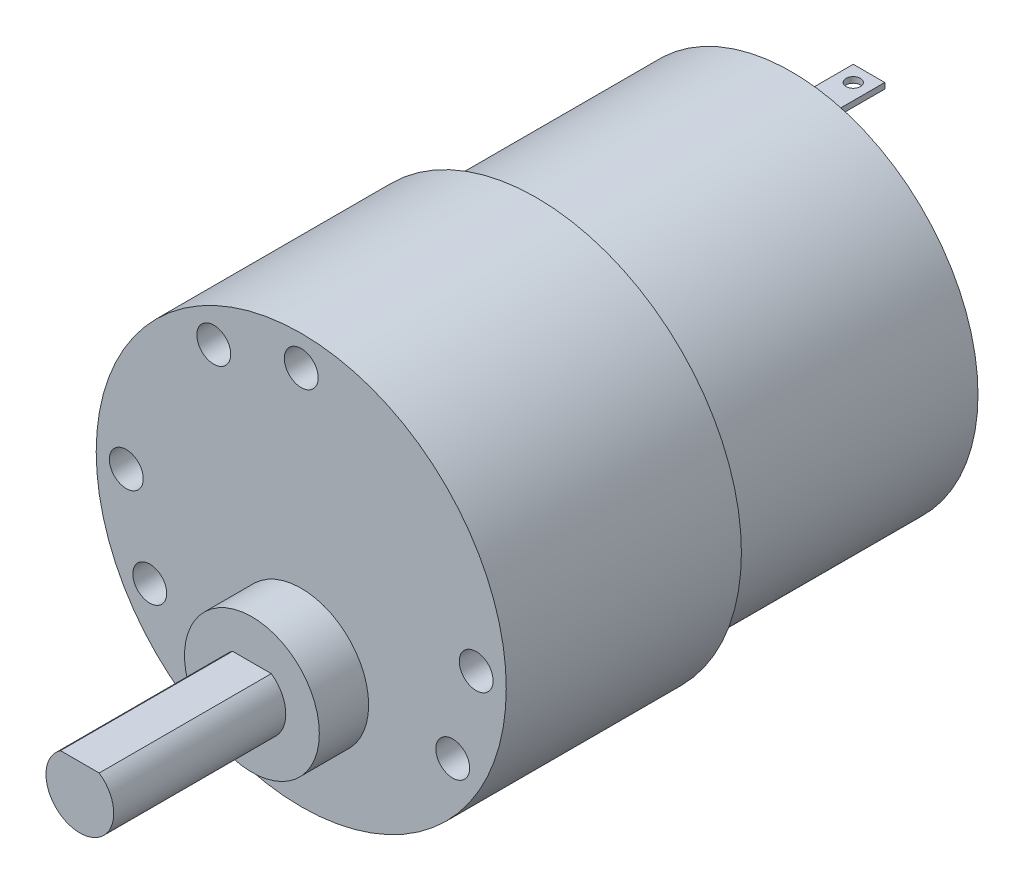
ISO-10303-21;
HEADER;
FILE_DESCRIPTION(('STEP AP214'),'2;1');
FILE_NAME('part.step','',(''),(''),'','','');
FILE_SCHEMA(('AUTOMOTIVE_DESIGN { 1 0 10303 214 1 1 1 1 }'));
ENDSEC;
DATA;
#1=APPLICATION_CONTEXT('core data for automotive mechanical design processes');
#2=APPLICATION_PROTOCOL_DEFINITION('international standard','automotive_design',2000,#1);
#3=PRODUCT_CONTEXT('',#1,'mechanical');
#4=PRODUCT('Part','Part','',(#3));
#5=PRODUCT_RELATED_PRODUCT_CATEGORY('part','',(#4));
#6=PRODUCT_DEFINITION_FORMATION('','',#4);
#7=PRODUCT_DEFINITION_CONTEXT('part definition',#1,'design');
#8=PRODUCT_DEFINITION('design','',#6,#7);
#9=PRODUCT_DEFINITION_SHAPE('','',#8);
#10=(LENGTH_UNIT() NAMED_UNIT(*) SI_UNIT(.MILLI.,.METRE.));
#11=(NAMED_UNIT(*) PLANE_ANGLE_UNIT() SI_UNIT($,.RADIAN.));
#12=(NAMED_UNIT(*) SI_UNIT($,.STERADIAN.) SOLID_ANGLE_UNIT());
#13=UNCERTAINTY_MEASURE_WITH_UNIT(LENGTH_MEASURE(1.E-05),#10,'distance_accuracy_value','');
#14=(GEOMETRIC_REPRESENTATION_CONTEXT(3) GLOBAL_UNCERTAINTY_ASSIGNED_CONTEXT((#13)) GLOBAL_UNIT_ASSIGNED_CONTEXT((#10,
#11,#12)) REPRESENTATION_CONTEXT('',''));
#15=CARTESIAN_POINT('',(0.,0.,0.));
#16=DIRECTION('',(0.,0.,1.));
#17=DIRECTION('',(1.,0.,0.));
#18=AXIS2_PLACEMENT_3D('',#15,#16,#17);
#19=CARTESIAN_POINT('',(0.,-12.7,-23.876));
#20=DIRECTION('',(0.,0.,-1.));
#21=DIRECTION('',(-1.,0.,0.));
#22=AXIS2_PLACEMENT_3D('',#19,#20,#21);
#23=PLANE('',#22);
#24=CARTESIAN_POINT('',(0.,-12.7,-23.876));
#25=DIRECTION('',(0.,0.,-1.));
#26=DIRECTION('',(-1.,0.,0.));
#27=AXIS2_PLACEMENT_3D('',#24,#25,#26);
#28=CIRCLE('',#27,2.413);
#29=CARTESIAN_POINT('',(-2.413,-12.7,-23.876));
#30=VERTEX_POINT('',#29);
#31=EDGE_CURVE('E278',#30,#30,#28,.T.);
#32=ORIENTED_EDGE('',*,*,#31,.T.);
#33=EDGE_LOOP('',(#32));
#34=FACE_BOUND('',#33,.T.);
#35=DIRECTION('',(-1.,0.,0.));
#36=VECTOR('',#35,1.);
#37=CARTESIAN_POINT('',(-1.397,-12.446,-23.876));
#38=LINE('',#37,#36);
#39=CARTESIAN_POINT('',(1.397,-12.446,-23.876));
#40=VERTEX_POINT('',#39);
#41=CARTESIAN_POINT('',(-1.397,-12.446,-23.876));
#42=VERTEX_POINT('',#41);
#43=EDGE_CURVE('E48',#40,#42,#38,.T.);
#44=ORIENTED_EDGE('',*,*,#43,.T.);
#45=DIRECTION('',(0.,1.,0.));
#46=VECTOR('',#45,1.);
#47=CARTESIAN_POINT('',(-1.397,-12.954,-23.876));
#48=LINE('',#47,#46);
#49=CARTESIAN_POINT('',(-1.397,-12.954,-23.876));
#50=VERTEX_POINT('',#49);
#51=EDGE_CURVE('E213',#50,#42,#48,.T.);
#52=ORIENTED_EDGE('',*,*,#51,.F.);
#53=DIRECTION('',(-1.,0.,0.));
#54=VECTOR('',#53,1.);
#55=CARTESIAN_POINT('',(-1.397,-12.954,-23.876));
#56=LINE('',#55,#54);
#57=CARTESIAN_POINT('',(1.397,-12.954,-23.876));
#58=VERTEX_POINT('',#57);
#59=EDGE_CURVE('E188',#58,#50,#56,.T.);
#60=ORIENTED_EDGE('',*,*,#59,.F.);
#61=DIRECTION('',(0.,1.,0.));
#62=VECTOR('',#61,1.);
#63=CARTESIAN_POINT('',(1.397,-12.954,-23.876));
#64=LINE('',#63,#62);
#65=EDGE_CURVE('E198',#58,#40,#64,.T.);
#66=ORIENTED_EDGE('',*,*,#65,.T.);
#67=EDGE_LOOP('',(#44,#52,#60,#66));
#68=FACE_BOUND('',#67,.T.);
#69=ADVANCED_FACE('F33',(#34,#68),#23,.T.);
#70=CARTESIAN_POINT('',(0.,12.7,-23.876));
#71=DIRECTION('',(0.,0.,-1.));
#72=DIRECTION('',(-1.,0.,0.));
#73=AXIS2_PLACEMENT_3D('',#70,#71,#72);
#74=PLANE('',#73);
#75=CARTESIAN_POINT('',(0.,12.7,-23.876));
#76=DIRECTION('',(0.,0.,-1.));
#77=DIRECTION('',(-1.,0.,0.));
#78=AXIS2_PLACEMENT_3D('',#75,#76,#77);
#79=CIRCLE('',#78,2.413);
#80=CARTESIAN_POINT('',(-2.413,12.7,-23.876));
#81=VERTEX_POINT('',#80);
#82=EDGE_CURVE('E272',#81,#81,#79,.T.);
#83=ORIENTED_EDGE('',*,*,#82,.T.);
#84=EDGE_LOOP('',(#83));
#85=FACE_BOUND('',#84,.T.);
#86=DIRECTION('',(1.,0.,0.));
#87=VECTOR('',#86,1.);
#88=CARTESIAN_POINT('',(1.397,12.446,-23.876));
#89=LINE('',#88,#87);
#90=CARTESIAN_POINT('',(-1.397,12.446,-23.876));
#91=VERTEX_POINT('',#90);
#92=CARTESIAN_POINT('',(1.397,12.446,-23.876));
#93=VERTEX_POINT('',#92);
#94=EDGE_CURVE('E56',#91,#93,#89,.T.);
#95=ORIENTED_EDGE('',*,*,#94,.T.);
#96=DIRECTION('',(0.,-1.,0.));
#97=VECTOR('',#96,1.);
#98=CARTESIAN_POINT('',(1.397,12.954,-23.876));
#99=LINE('',#98,#97);
#100=CARTESIAN_POINT('',(1.397,12.954,-23.876));
#101=VERTEX_POINT('',#100);
#102=EDGE_CURVE('E247',#101,#93,#99,.T.);
#103=ORIENTED_EDGE('',*,*,#102,.F.);
#104=DIRECTION('',(1.,0.,0.));
#105=VECTOR('',#104,1.);
#106=CARTESIAN_POINT('',(1.397,12.954,-23.876));
#107=LINE('',#106,#105);
#108=CARTESIAN_POINT('',(-1.397,12.954,-23.876));
#109=VERTEX_POINT('',#108);
#110=EDGE_CURVE('E222',#109,#101,#107,.T.);
#111=ORIENTED_EDGE('',*,*,#110,.F.);
#112=DIRECTION('',(0.,-1.,0.));
#113=VECTOR('',#112,1.);
#114=CARTESIAN_POINT('',(-1.397,12.954,-23.876));
#115=LINE('',#114,#113);
#116=EDGE_CURVE('E232',#109,#91,#115,.T.);
#117=ORIENTED_EDGE('',*,*,#116,.T.);
#118=EDGE_LOOP('',(#95,#103,#111,#117));
#119=FACE_BOUND('',#118,.T.);
#120=ADVANCED_FACE('F321',(#85,#119),#74,.T.);
#121=CARTESIAN_POINT('',(0.,-7.366,25.1968));
#122=DIRECTION('',(0.,0.,1.));
#123=DIRECTION('',(1.,0.,0.));
#124=AXIS2_PLACEMENT_3D('',#121,#122,#123);
#125=PLANE('',#124);
#126=CARTESIAN_POINT('',(0.,-7.366,25.1968));
#127=DIRECTION('',(0.,0.,1.));
#128=DIRECTION('',(1.,0.,0.));
#129=AXIS2_PLACEMENT_3D('',#126,#127,#128);
#130=CIRCLE('',#129,5.969);
#131=CARTESIAN_POINT('',(5.969,-7.366,25.1968));
#132=VERTEX_POINT('',#131);
#133=EDGE_CURVE('E266',#132,#132,#130,.T.);
#134=ORIENTED_EDGE('',*,*,#133,.T.);
#135=EDGE_LOOP('',(#134));
#136=FACE_BOUND('',#135,.T.);
#137=DIRECTION('',(-1.,0.,0.));
#138=VECTOR('',#137,1.);
#139=CARTESIAN_POINT('',(-1.71565701700544,-4.905,25.1968));
#140=LINE('',#139,#138);
#141=CARTESIAN_POINT('',(1.71565701700544,-4.905,25.1968));
#142=VERTEX_POINT('',#141);
#143=CARTESIAN_POINT('',(-1.71565701700544,-4.905,25.1968));
#144=VERTEX_POINT('',#143);
#145=EDGE_CURVE('E255',#142,#144,#140,.T.);
#146=ORIENTED_EDGE('',*,*,#145,.F.);
#147=CARTESIAN_POINT('',(0.,-7.366,25.1968));
#148=DIRECTION('',(0.,0.,1.));
#149=DIRECTION('',(1.,0.,0.));
#150=AXIS2_PLACEMENT_3D('',#147,#148,#149);
#151=CIRCLE('',#150,3.);
#152=EDGE_CURVE('E250',#144,#142,#151,.T.);
#153=ORIENTED_EDGE('',*,*,#152,.F.);
#154=EDGE_LOOP('',(#146,#153));
#155=FACE_BOUND('',#154,.T.);
#156=ADVANCED_FACE('F327',(#136,#155),#125,.T.);
#157=CARTESIAN_POINT('',(0.,0.,20.828));
#158=DIRECTION('',(0.,0.,1.));
#159=DIRECTION('',(1.,0.,0.));
#160=AXIS2_PLACEMENT_3D('',#157,#158,#159);
#161=PLANE('',#160);
#162=CARTESIAN_POINT('',(-7.74699999999983,13.4181976062362,20.828));
#163=DIRECTION('',(0.,0.,1.));
#164=DIRECTION('',(1.,0.,0.));
#165=AXIS2_PLACEMENT_3D('',#162,#163,#164);
#166=CIRCLE('',#165,1.49999999999999);
#167=CARTESIAN_POINT('',(-6.24699999999984,13.4181976062362,20.828));
#168=VERTEX_POINT('',#167);
#169=EDGE_CURVE('E142',#168,#168,#166,.T.);
#170=ORIENTED_EDGE('',*,*,#169,.F.);
#171=EDGE_LOOP('',(#170));
#172=FACE_BOUND('',#171,.T.);
#173=CARTESIAN_POINT('',(-15.494,1.62291035592107E-13,20.828));
#174=DIRECTION('',(0.,0.,1.));
#175=DIRECTION('',(1.,0.,0.));
#176=AXIS2_PLACEMENT_3D('',#173,#174,#175);
#177=CIRCLE('',#176,1.49999999999999);
#178=CARTESIAN_POINT('',(-13.994,1.62291035592107E-13,20.828));
#179=VERTEX_POINT('',#178);
#180=EDGE_CURVE('E141',#179,#179,#177,.T.);
#181=ORIENTED_EDGE('',*,*,#180,.F.);
#182=EDGE_LOOP('',(#181));
#183=FACE_BOUND('',#182,.T.);
#184=CARTESIAN_POINT('',(-13.4181976062362,-7.74699999999987,20.828));
#185=DIRECTION('',(0.,0.,1.));
#186=DIRECTION('',(1.,0.,0.));
#187=AXIS2_PLACEMENT_3D('',#184,#185,#186);
#188=CIRCLE('',#187,1.49999999999999);
#189=CARTESIAN_POINT('',(-11.9181976062362,-7.74699999999987,20.828));
#190=VERTEX_POINT('',#189);
#191=EDGE_CURVE('E152',#190,#190,#188,.T.);
#192=ORIENTED_EDGE('',*,*,#191,.F.);
#193=EDGE_LOOP('',(#192));
#194=FACE_BOUND('',#193,.T.);
#195=CARTESIAN_POINT('',(-7.74700000000011,-13.418197606236,20.828));
#196=DIRECTION('',(0.,0.,1.));
#197=DIRECTION('',(1.,0.,0.));
#198=AXIS2_PLACEMENT_3D('',#195,#196,#197);
#199=CIRCLE('',#198,1.49999999999999);
#200=CARTESIAN_POINT('',(-6.24700000000012,-13.418197606236,20.828));
#201=VERTEX_POINT('',#200);
#202=EDGE_CURVE('E158',#201,#201,#199,.T.);
#203=ORIENTED_EDGE('',*,*,#202,.F.);
#204=EDGE_LOOP('',(#203));
#205=FACE_BOUND('',#204,.T.);
#206=CARTESIAN_POINT('',(13.4181976062361,-7.74700000000006,20.828));
#207=DIRECTION('',(0.,0.,1.));
#208=DIRECTION('',(1.,0.,0.));
#209=AXIS2_PLACEMENT_3D('',#206,#207,#208);
#210=CIRCLE('',#209,1.49999999999999);
#211=CARTESIAN_POINT('',(14.918197606236,-7.74700000000006,20.828));
#212=VERTEX_POINT('',#211);
#213=EDGE_CURVE('E164',#212,#212,#210,.T.);
#214=ORIENTED_EDGE('',*,*,#213,.F.);
#215=EDGE_LOOP('',(#214));
#216=FACE_BOUND('',#215,.T.);
#217=CARTESIAN_POINT('',(15.494,0.,20.828));
#218=DIRECTION('',(0.,0.,1.));
#219=DIRECTION('',(1.,0.,0.));
#220=AXIS2_PLACEMENT_3D('',#217,#218,#219);
#221=CIRCLE('',#220,1.49999999999999);
#222=CARTESIAN_POINT('',(16.994,0.,20.828));
#223=VERTEX_POINT('',#222);
#224=EDGE_CURVE('E170',#223,#223,#221,.T.);
#225=ORIENTED_EDGE('',*,*,#224,.F.);
#226=EDGE_LOOP('',(#225));
#227=FACE_BOUND('',#226,.T.);
#228=CARTESIAN_POINT('',(0.,15.494,20.828));
#229=DIRECTION('',(0.,0.,1.));
#230=DIRECTION('',(1.,0.,0.));
#231=AXIS2_PLACEMENT_3D('',#228,#229,#230);
#232=CIRCLE('',#231,1.49999999999999);
#233=CARTESIAN_POINT('',(1.49999999999999,15.494,20.828));
#234=VERTEX_POINT('',#233);
#235=EDGE_CURVE('E176',#234,#234,#232,.T.);
#236=ORIENTED_EDGE('',*,*,#235,.F.);
#237=EDGE_LOOP('',(#236));
#238=FACE_BOUND('',#237,.T.);
#239=CARTESIAN_POINT('',(0.,0.,20.828));
#240=DIRECTION('',(0.,0.,1.));
#241=DIRECTION('',(1.,0.,0.));
#242=AXIS2_PLACEMENT_3D('',#239,#240,#241);
#243=CIRCLE('',#242,18.161);
#244=CARTESIAN_POINT('',(18.161,0.,20.828));
#245=VERTEX_POINT('',#244);
#246=EDGE_CURVE('E41',#245,#245,#243,.T.);
#247=ORIENTED_EDGE('',*,*,#246,.T.);
#248=EDGE_LOOP('',(#247));
#249=FACE_BOUND('',#248,.T.);
#250=CARTESIAN_POINT('',(0.,-7.366,20.828));
#251=DIRECTION('',(0.,0.,1.));
#252=DIRECTION('',(1.,0.,0.));
#253=AXIS2_PLACEMENT_3D('',#250,#251,#252);
#254=CIRCLE('',#253,5.969);
#255=CARTESIAN_POINT('',(5.969,-7.366,20.828));
#256=VERTEX_POINT('',#255);
#257=EDGE_CURVE('E265',#256,#256,#254,.T.);
#258=ORIENTED_EDGE('',*,*,#257,.F.);
#259=EDGE_LOOP('',(#258));
#260=FACE_BOUND('',#259,.T.);
#261=ADVANCED_FACE('F341',(#172,#183,#194,#205,#216,#227,#238,#249,#260),#161,.T.);
#262=CARTESIAN_POINT('',(0.,0.,-22.606));
#263=DIRECTION('',(0.,0.,-1.));
#264=DIRECTION('',(-1.,0.,0.));
#265=AXIS2_PLACEMENT_3D('',#262,#263,#264);
#266=PLANE('',#265);
#267=CARTESIAN_POINT('',(0.,-12.7,-22.606));
#268=DIRECTION('',(0.,0.,-1.));
#269=DIRECTION('',(-1.,0.,0.));
#270=AXIS2_PLACEMENT_3D('',#267,#268,#269);
#271=CIRCLE('',#270,2.413);
#272=CARTESIAN_POINT('',(-2.413,-12.7,-22.606));
#273=VERTEX_POINT('',#272);
#274=EDGE_CURVE('E275',#273,#273,#271,.T.);
#275=ORIENTED_EDGE('',*,*,#274,.F.);
#276=EDGE_LOOP('',(#275));
#277=FACE_BOUND('',#276,.T.);
#278=CARTESIAN_POINT('',(0.,0.,-22.606));
#279=DIRECTION('',(0.,0.,-1.));
#280=DIRECTION('',(-1.,0.,0.));
#281=AXIS2_PLACEMENT_3D('',#278,#279,#280);
#282=CIRCLE('',#281,16.51);
#283=CARTESIAN_POINT('',(-16.51,0.,-22.606));
#284=VERTEX_POINT('',#283);
#285=EDGE_CURVE('E287',#284,#284,#282,.T.);
#286=ORIENTED_EDGE('',*,*,#285,.T.);
#287=EDGE_LOOP('',(#286));
#288=FACE_BOUND('',#287,.T.);
#289=CARTESIAN_POINT('',(0.,0.,-22.606));
#290=DIRECTION('',(0.,0.,-1.));
#291=DIRECTION('',(-1.,0.,0.));
#292=AXIS2_PLACEMENT_3D('',#289,#290,#291);
#293=CIRCLE('',#292,4.5085);
#294=CARTESIAN_POINT('',(-4.5085,0.,-22.606));
#295=VERTEX_POINT('',#294);
#296=EDGE_CURVE('E281',#295,#295,#293,.T.);
#297=ORIENTED_EDGE('',*,*,#296,.F.);
#298=EDGE_LOOP('',(#297));
#299=FACE_BOUND('',#298,.T.);
#300=CARTESIAN_POINT('',(0.,12.7,-22.606));
#301=DIRECTION('',(0.,0.,-1.));
#302=DIRECTION('',(-1.,0.,0.));
#303=AXIS2_PLACEMENT_3D('',#300,#301,#302);
#304=CIRCLE('',#303,2.413);
#305=CARTESIAN_POINT('',(-2.413,12.7,-22.606));
#306=VERTEX_POINT('',#305);
#307=EDGE_CURVE('E269',#306,#306,#304,.T.);
#308=ORIENTED_EDGE('',*,*,#307,.F.);
#309=EDGE_LOOP('',(#308));
#310=FACE_BOUND('',#309,.T.);
#311=ADVANCED_FACE('F301',(#277,#288,#299,#310),#266,.T.);
#312=CARTESIAN_POINT('',(0.,0.,0.));
#313=DIRECTION('',(0.,0.,1.));
#314=DIRECTION('',(1.,0.,0.));
#315=AXIS2_PLACEMENT_3D('',#312,#313,#314);
#316=PLANE('',#315);
#317=CARTESIAN_POINT('',(0.,0.,0.));
#318=DIRECTION('',(0.,0.,1.));
#319=DIRECTION('',(1.,0.,0.));
#320=AXIS2_PLACEMENT_3D('',#317,#318,#319);
#321=CIRCLE('',#320,18.161);
#322=CARTESIAN_POINT('',(18.161,0.,0.));
#323=VERTEX_POINT('',#322);
#324=EDGE_CURVE('E292',#323,#323,#321,.T.);
#325=ORIENTED_EDGE('',*,*,#324,.F.);
#326=EDGE_LOOP('',(#325));
#327=FACE_BOUND('',#326,.T.);
#328=CARTESIAN_POINT('',(0.,0.,0.));
#329=DIRECTION('',(0.,0.,1.));
#330=DIRECTION('',(1.,0.,0.));
#331=AXIS2_PLACEMENT_3D('',#328,#329,#330);
#332=CIRCLE('',#331,16.51);
#333=CARTESIAN_POINT('',(16.51,0.,0.));
#334=VERTEX_POINT('',#333);
#335=EDGE_CURVE('E11',#334,#334,#332,.F.);
#336=ORIENTED_EDGE('',*,*,#335,.F.);
#337=EDGE_LOOP('',(#336));
#338=FACE_BOUND('',#337,.T.);
#339=ADVANCED_FACE('F298',(#327,#338),#316,.F.);
#340=CARTESIAN_POINT('',(0.,0.,20.828));
#341=DIRECTION('',(0.,0.,-1.));
#342=DIRECTION('',(-1.,0.,0.));
#343=AXIS2_PLACEMENT_3D('',#340,#341,#342);
#344=CYLINDRICAL_SURFACE('',#343,18.161);
#345=ORIENTED_EDGE('',*,*,#246,.F.);
#346=EDGE_LOOP('',(#345));
#347=FACE_BOUND('',#346,.T.);
#348=ORIENTED_EDGE('',*,*,#324,.T.);
#349=EDGE_LOOP('',(#348));
#350=FACE_BOUND('',#349,.T.);
#351=ADVANCED_FACE('F35',(#347,#350),#344,.T.);
#352=CARTESIAN_POINT('',(0.,0.,-22.606));
#353=DIRECTION('',(0.,0.,1.));
#354=DIRECTION('',(1.,0.,0.));
#355=AXIS2_PLACEMENT_3D('',#352,#353,#354);
#356=CYLINDRICAL_SURFACE('',#355,16.51);
#357=ORIENTED_EDGE('',*,*,#285,.F.);
#358=EDGE_LOOP('',(#357));
#359=FACE_BOUND('',#358,.T.);
#360=ORIENTED_EDGE('',*,*,#335,.T.);
#361=EDGE_LOOP('',(#360));
#362=FACE_BOUND('',#361,.T.);
#363=ADVANCED_FACE('F304',(#359,#362),#356,.T.);
#364=CARTESIAN_POINT('',(0.,0.,-25.908));
#365=DIRECTION('',(0.,0.,1.));
#366=DIRECTION('',(1.,0.,0.));
#367=AXIS2_PLACEMENT_3D('',#364,#365,#366);
#368=CYLINDRICAL_SURFACE('',#367,4.5085);
#369=CARTESIAN_POINT('',(0.,0.,-25.908));
#370=DIRECTION('',(0.,0.,-1.));
#371=DIRECTION('',(-1.,0.,0.));
#372=AXIS2_PLACEMENT_3D('',#369,#370,#371);
#373=CIRCLE('',#372,4.5085);
#374=CARTESIAN_POINT('',(-4.5085,0.,-25.908));
#375=VERTEX_POINT('',#374);
#376=EDGE_CURVE('E284',#375,#375,#373,.T.);
#377=ORIENTED_EDGE('',*,*,#376,.F.);
#378=EDGE_LOOP('',(#377));
#379=FACE_BOUND('',#378,.T.);
#380=ORIENTED_EDGE('',*,*,#296,.T.);
#381=EDGE_LOOP('',(#380));
#382=FACE_BOUND('',#381,.T.);
#383=ADVANCED_FACE('F306',(#379,#382),#368,.T.);
#384=CARTESIAN_POINT('',(0.,0.,-25.908));
#385=DIRECTION('',(0.,0.,-1.));
#386=DIRECTION('',(-1.,0.,0.));
#387=AXIS2_PLACEMENT_3D('',#384,#385,#386);
#388=PLANE('',#387);
#389=ORIENTED_EDGE('',*,*,#376,.T.);
#390=EDGE_LOOP('',(#389));
#391=FACE_BOUND('',#390,.T.);
#392=ADVANCED_FACE('F313',(#391),#388,.T.);
#393=CARTESIAN_POINT('',(0.,-12.7,-23.876));
#394=DIRECTION('',(0.,0.,1.));
#395=DIRECTION('',(1.,0.,0.));
#396=AXIS2_PLACEMENT_3D('',#393,#394,#395);
#397=CYLINDRICAL_SURFACE('',#396,2.413);
#398=ORIENTED_EDGE('',*,*,#31,.F.);
#399=EDGE_LOOP('',(#398));
#400=FACE_BOUND('',#399,.T.);
#401=ORIENTED_EDGE('',*,*,#274,.T.);
#402=EDGE_LOOP('',(#401));
#403=FACE_BOUND('',#402,.T.);
#404=ADVANCED_FACE('F334',(#400,#403),#397,.T.);
#405=CARTESIAN_POINT('',(0.,12.7,-23.876));
#406=DIRECTION('',(0.,0.,1.));
#407=DIRECTION('',(1.,0.,0.));
#408=AXIS2_PLACEMENT_3D('',#405,#406,#407);
#409=CYLINDRICAL_SURFACE('',#408,2.413);
#410=ORIENTED_EDGE('',*,*,#82,.F.);
#411=EDGE_LOOP('',(#410));
#412=FACE_BOUND('',#411,.T.);
#413=ORIENTED_EDGE('',*,*,#307,.T.);
#414=EDGE_LOOP('',(#413));
#415=FACE_BOUND('',#414,.T.);
#416=ADVANCED_FACE('F333',(#412,#415),#409,.T.);
#417=CARTESIAN_POINT('',(0.,-7.366,25.1968));
#418=DIRECTION('',(0.,0.,-1.));
#419=DIRECTION('',(-1.,0.,0.));
#420=AXIS2_PLACEMENT_3D('',#417,#418,#419);
#421=CYLINDRICAL_SURFACE('',#420,5.969);
#422=ORIENTED_EDGE('',*,*,#133,.F.);
#423=EDGE_LOOP('',(#422));
#424=FACE_BOUND('',#423,.T.);
#425=ORIENTED_EDGE('',*,*,#257,.T.);
#426=EDGE_LOOP('',(#425));
#427=FACE_BOUND('',#426,.T.);
#428=ADVANCED_FACE('F355',(#424,#427),#421,.T.);
#429=CARTESIAN_POINT('',(0.,-7.366,40.4368));
#430=DIRECTION('',(0.,0.,-1.));
#431=DIRECTION('',(-1.,0.,0.));
#432=AXIS2_PLACEMENT_3D('',#429,#430,#431);
#433=CYLINDRICAL_SURFACE('',#432,3.);
#434=ORIENTED_EDGE('',*,*,#152,.T.);
#435=DIRECTION('',(0.,0.,-1.));
#436=VECTOR('',#435,1.);
#437=CARTESIAN_POINT('',(1.71565701700544,-4.905,40.4368));
#438=LINE('',#437,#436);
#439=CARTESIAN_POINT('',(1.71565701700544,-4.905,40.4368));
#440=VERTEX_POINT('',#439);
#441=EDGE_CURVE('E262',#440,#142,#438,.T.);
#442=ORIENTED_EDGE('',*,*,#441,.F.);
#443=CARTESIAN_POINT('',(0.,-7.366,40.4368));
#444=DIRECTION('',(0.,0.,1.));
#445=DIRECTION('',(1.,0.,0.));
#446=AXIS2_PLACEMENT_3D('',#443,#444,#445);
#447=CIRCLE('',#446,3.);
#448=CARTESIAN_POINT('',(-1.71565701700544,-4.905,40.4368));
#449=VERTEX_POINT('',#448);
#450=EDGE_CURVE('E251',#449,#440,#447,.T.);
#451=ORIENTED_EDGE('',*,*,#450,.F.);
#452=DIRECTION('',(0.,0.,-1.));
#453=VECTOR('',#452,1.);
#454=CARTESIAN_POINT('',(-1.71565701700544,-4.905,40.4368));
#455=LINE('',#454,#453);
#456=EDGE_CURVE('E257',#449,#144,#455,.T.);
#457=ORIENTED_EDGE('',*,*,#456,.T.);
#458=EDGE_LOOP('',(#434,#442,#451,#457));
#459=FACE_BOUND('',#458,.T.);
#460=ADVANCED_FACE('F360',(#459),#433,.T.);
#461=CARTESIAN_POINT('',(-1.71565701700544,-4.905,40.4368));
#462=DIRECTION('',(0.,-1.,0.));
#463=DIRECTION('',(0.,0.,-1.));
#464=AXIS2_PLACEMENT_3D('',#461,#462,#463);
#465=PLANE('',#464);
#466=ORIENTED_EDGE('',*,*,#145,.T.);
#467=ORIENTED_EDGE('',*,*,#456,.F.);
#468=DIRECTION('',(-1.,0.,0.));
#469=VECTOR('',#468,1.);
#470=CARTESIAN_POINT('',(-1.71565701700544,-4.905,40.4368));
#471=LINE('',#470,#469);
#472=EDGE_CURVE('E254',#440,#449,#471,.T.);
#473=ORIENTED_EDGE('',*,*,#472,.F.);
#474=ORIENTED_EDGE('',*,*,#441,.T.);
#475=EDGE_LOOP('',(#466,#467,#473,#474));
#476=FACE_BOUND('',#475,.T.);
#477=ADVANCED_FACE('F408',(#476),#465,.F.);
#478=CARTESIAN_POINT('',(0.,-7.366,40.4368));
#479=DIRECTION('',(0.,0.,1.));
#480=DIRECTION('',(1.,0.,0.));
#481=AXIS2_PLACEMENT_3D('',#478,#479,#480);
#482=PLANE('',#481);
#483=ORIENTED_EDGE('',*,*,#450,.T.);
#484=ORIENTED_EDGE('',*,*,#472,.T.);
#485=EDGE_LOOP('',(#483,#484));
#486=FACE_BOUND('',#485,.T.);
#487=ADVANCED_FACE('F385',(#486),#482,.T.);
#488=CARTESIAN_POINT('',(0.,12.954,0.));
#489=DIRECTION('',(0.,-1.,0.));
#490=DIRECTION('',(0.,0.,-1.));
#491=AXIS2_PLACEMENT_3D('',#488,#489,#490);
#492=PLANE('',#491);
#493=ORIENTED_EDGE('',*,*,#110,.T.);
#494=DIRECTION('',(0.,0.,-1.));
#495=VECTOR('',#494,1.);
#496=CARTESIAN_POINT('',(1.397,12.954,-23.876));
#497=LINE('',#496,#495);
#498=CARTESIAN_POINT('',(1.397,12.954,-29.464));
#499=VERTEX_POINT('',#498);
#500=EDGE_CURVE('E225',#101,#499,#497,.T.);
#501=ORIENTED_EDGE('',*,*,#500,.T.);
#502=DIRECTION('',(-1.,0.,0.));
#503=VECTOR('',#502,1.);
#504=CARTESIAN_POINT('',(1.397,12.954,-29.464));
#505=LINE('',#504,#503);
#506=CARTESIAN_POINT('',(-1.397,12.954,-29.464));
#507=VERTEX_POINT('',#506);
#508=EDGE_CURVE('E228',#499,#507,#505,.T.);
#509=ORIENTED_EDGE('',*,*,#508,.T.);
#510=DIRECTION('',(0.,0.,1.));
#511=VECTOR('',#510,1.);
#512=CARTESIAN_POINT('',(-1.397,12.954,-23.876));
#513=LINE('',#512,#511);
#514=EDGE_CURVE('E230',#507,#109,#513,.T.);
#515=ORIENTED_EDGE('',*,*,#514,.T.);
#516=EDGE_LOOP('',(#493,#501,#509,#515));
#517=FACE_BOUND('',#516,.T.);
#518=CARTESIAN_POINT('',(0.,12.954,-28.067));
#519=DIRECTION('',(0.,1.,0.));
#520=DIRECTION('',(0.,0.,1.));
#521=AXIS2_PLACEMENT_3D('',#518,#519,#520);
#522=CIRCLE('',#521,0.634999999999999);
#523=CARTESIAN_POINT('',(0.,12.954,-27.432));
#524=VERTEX_POINT('',#523);
#525=EDGE_CURVE('E217',#524,#524,#522,.T.);
#526=ORIENTED_EDGE('',*,*,#525,.F.);
#527=EDGE_LOOP('',(#526));
#528=FACE_BOUND('',#527,.T.);
#529=ADVANCED_FACE('F382',(#517,#528),#492,.F.);
#530=CARTESIAN_POINT('',(0.,12.446,0.));
#531=DIRECTION('',(0.,-1.,0.));
#532=DIRECTION('',(0.,0.,-1.));
#533=AXIS2_PLACEMENT_3D('',#530,#531,#532);
#534=PLANE('',#533);
#535=ORIENTED_EDGE('',*,*,#94,.F.);
#536=DIRECTION('',(0.,0.,1.));
#537=VECTOR('',#536,1.);
#538=CARTESIAN_POINT('',(-1.397,12.446,-23.876));
#539=LINE('',#538,#537);
#540=CARTESIAN_POINT('',(-1.397,12.446,-29.464));
#541=VERTEX_POINT('',#540);
#542=EDGE_CURVE('E226',#541,#91,#539,.T.);
#543=ORIENTED_EDGE('',*,*,#542,.F.);
#544=DIRECTION('',(-1.,0.,0.));
#545=VECTOR('',#544,1.);
#546=CARTESIAN_POINT('',(1.397,12.446,-29.464));
#547=LINE('',#546,#545);
#548=CARTESIAN_POINT('',(1.397,12.446,-29.464));
#549=VERTEX_POINT('',#548);
#550=EDGE_CURVE('E236',#549,#541,#547,.T.);
#551=ORIENTED_EDGE('',*,*,#550,.F.);
#552=DIRECTION('',(0.,0.,-1.));
#553=VECTOR('',#552,1.);
#554=CARTESIAN_POINT('',(1.397,12.446,-23.876));
#555=LINE('',#554,#553);
#556=EDGE_CURVE('E234',#93,#549,#555,.T.);
#557=ORIENTED_EDGE('',*,*,#556,.F.);
#558=EDGE_LOOP('',(#535,#543,#551,#557));
#559=FACE_BOUND('',#558,.T.);
#560=CARTESIAN_POINT('',(0.,12.446,-28.067));
#561=DIRECTION('',(0.,1.,0.));
#562=DIRECTION('',(0.,0.,1.));
#563=AXIS2_PLACEMENT_3D('',#560,#561,#562);
#564=CIRCLE('',#563,0.634999999999999);
#565=CARTESIAN_POINT('',(0.,12.446,-27.432));
#566=VERTEX_POINT('',#565);
#567=EDGE_CURVE('E216',#566,#566,#564,.T.);
#568=ORIENTED_EDGE('',*,*,#567,.T.);
#569=EDGE_LOOP('',(#568));
#570=FACE_BOUND('',#569,.T.);
#571=ADVANCED_FACE('F373',(#559,#570),#534,.T.);
#572=CARTESIAN_POINT('',(1.397,12.954,-23.876));
#573=DIRECTION('',(-1.,0.,0.));
#574=DIRECTION('',(0.,0.,1.));
#575=AXIS2_PLACEMENT_3D('',#572,#573,#574);
#576=PLANE('',#575);
#577=ORIENTED_EDGE('',*,*,#556,.T.);
#578=DIRECTION('',(0.,-1.,0.));
#579=VECTOR('',#578,1.);
#580=CARTESIAN_POINT('',(1.397,12.954,-29.464));
#581=LINE('',#580,#579);
#582=EDGE_CURVE('E244',#499,#549,#581,.T.);
#583=ORIENTED_EDGE('',*,*,#582,.F.);
#584=ORIENTED_EDGE('',*,*,#500,.F.);
#585=ORIENTED_EDGE('',*,*,#102,.T.);
#586=EDGE_LOOP('',(#577,#583,#584,#585));
#587=FACE_BOUND('',#586,.T.);
#588=ADVANCED_FACE('F380',(#587),#576,.F.);
#589=CARTESIAN_POINT('',(1.397,12.954,-29.464));
#590=DIRECTION('',(0.,0.,1.));
#591=DIRECTION('',(1.,0.,0.));
#592=AXIS2_PLACEMENT_3D('',#589,#590,#591);
#593=PLANE('',#592);
#594=ORIENTED_EDGE('',*,*,#550,.T.);
#595=DIRECTION('',(0.,-1.,0.));
#596=VECTOR('',#595,1.);
#597=CARTESIAN_POINT('',(-1.397,12.954,-29.464));
#598=LINE('',#597,#596);
#599=EDGE_CURVE('E241',#507,#541,#598,.T.);
#600=ORIENTED_EDGE('',*,*,#599,.F.);
#601=ORIENTED_EDGE('',*,*,#508,.F.);
#602=ORIENTED_EDGE('',*,*,#582,.T.);
#603=EDGE_LOOP('',(#594,#600,#601,#602));
#604=FACE_BOUND('',#603,.T.);
#605=ADVANCED_FACE('F376',(#604),#593,.F.);
#606=CARTESIAN_POINT('',(-1.397,12.954,-23.876));
#607=DIRECTION('',(1.,0.,0.));
#608=DIRECTION('',(0.,0.,-1.));
#609=AXIS2_PLACEMENT_3D('',#606,#607,#608);
#610=PLANE('',#609);
#611=ORIENTED_EDGE('',*,*,#542,.T.);
#612=ORIENTED_EDGE('',*,*,#116,.F.);
#613=ORIENTED_EDGE('',*,*,#514,.F.);
#614=ORIENTED_EDGE('',*,*,#599,.T.);
#615=EDGE_LOOP('',(#611,#612,#613,#614));
#616=FACE_BOUND('',#615,.T.);
#617=ADVANCED_FACE('F370',(#616),#610,.F.);
#618=CARTESIAN_POINT('',(0.,12.954,-28.067));
#619=DIRECTION('',(0.,-1.,0.));
#620=DIRECTION('',(0.,0.,-1.));
#621=AXIS2_PLACEMENT_3D('',#618,#619,#620);
#622=CYLINDRICAL_SURFACE('',#621,0.634999999999999);
#623=ORIENTED_EDGE('',*,*,#525,.T.);
#624=EDGE_LOOP('',(#623));
#625=FACE_BOUND('',#624,.T.);
#626=ORIENTED_EDGE('',*,*,#567,.F.);
#627=EDGE_LOOP('',(#626));
#628=FACE_BOUND('',#627,.T.);
#629=ADVANCED_FACE('F389',(#625,#628),#622,.F.);
#630=CARTESIAN_POINT('',(0.,-12.954,0.));
#631=DIRECTION('',(0.,1.,0.));
#632=DIRECTION('',(0.,0.,-1.));
#633=AXIS2_PLACEMENT_3D('',#630,#631,#632);
#634=PLANE('',#633);
#635=ORIENTED_EDGE('',*,*,#59,.T.);
#636=DIRECTION('',(0.,0.,-1.));
#637=VECTOR('',#636,1.);
#638=CARTESIAN_POINT('',(-1.397,-12.954,-23.876));
#639=LINE('',#638,#637);
#640=CARTESIAN_POINT('',(-1.397,-12.954,-29.464));
#641=VERTEX_POINT('',#640);
#642=EDGE_CURVE('E191',#50,#641,#639,.T.);
#643=ORIENTED_EDGE('',*,*,#642,.T.);
#644=DIRECTION('',(1.,0.,0.));
#645=VECTOR('',#644,1.);
#646=CARTESIAN_POINT('',(-1.397,-12.954,-29.464));
#647=LINE('',#646,#645);
#648=CARTESIAN_POINT('',(1.397,-12.954,-29.464));
#649=VERTEX_POINT('',#648);
#650=EDGE_CURVE('E194',#641,#649,#647,.T.);
#651=ORIENTED_EDGE('',*,*,#650,.T.);
#652=DIRECTION('',(0.,0.,1.));
#653=VECTOR('',#652,1.);
#654=CARTESIAN_POINT('',(1.397,-12.954,-23.876));
#655=LINE('',#654,#653);
#656=EDGE_CURVE('E196',#649,#58,#655,.T.);
#657=ORIENTED_EDGE('',*,*,#656,.T.);
#658=EDGE_LOOP('',(#635,#643,#651,#657));
#659=FACE_BOUND('',#658,.T.);
#660=CARTESIAN_POINT('',(0.,-12.954,-28.067));
#661=DIRECTION('',(0.,-1.,0.));
#662=DIRECTION('',(0.,0.,1.));
#663=AXIS2_PLACEMENT_3D('',#660,#661,#662);
#664=CIRCLE('',#663,0.634999999999999);
#665=CARTESIAN_POINT('',(0.,-12.954,-27.432));
#666=VERTEX_POINT('',#665);
#667=EDGE_CURVE('E183',#666,#666,#664,.T.);
#668=ORIENTED_EDGE('',*,*,#667,.F.);
#669=EDGE_LOOP('',(#668));
#670=FACE_BOUND('',#669,.T.);
#671=ADVANCED_FACE('F392',(#659,#670),#634,.F.);
#672=CARTESIAN_POINT('',(0.,-12.446,0.));
#673=DIRECTION('',(0.,1.,0.));
#674=DIRECTION('',(0.,0.,-1.));
#675=AXIS2_PLACEMENT_3D('',#672,#673,#674);
#676=PLANE('',#675);
#677=ORIENTED_EDGE('',*,*,#43,.F.);
#678=DIRECTION('',(0.,0.,1.));
#679=VECTOR('',#678,1.);
#680=CARTESIAN_POINT('',(1.397,-12.446,-23.876));
#681=LINE('',#680,#679);
#682=CARTESIAN_POINT('',(1.397,-12.446,-29.464));
#683=VERTEX_POINT('',#682);
#684=EDGE_CURVE('E192',#683,#40,#681,.T.);
#685=ORIENTED_EDGE('',*,*,#684,.F.);
#686=DIRECTION('',(1.,0.,0.));
#687=VECTOR('',#686,1.);
#688=CARTESIAN_POINT('',(-1.397,-12.446,-29.464));
#689=LINE('',#688,#687);
#690=CARTESIAN_POINT('',(-1.397,-12.446,-29.464));
#691=VERTEX_POINT('',#690);
#692=EDGE_CURVE('E202',#691,#683,#689,.T.);
#693=ORIENTED_EDGE('',*,*,#692,.F.);
#694=DIRECTION('',(0.,0.,-1.));
#695=VECTOR('',#694,1.);
#696=CARTESIAN_POINT('',(-1.397,-12.446,-23.876));
#697=LINE('',#696,#695);
#698=EDGE_CURVE('E200',#42,#691,#697,.T.);
#699=ORIENTED_EDGE('',*,*,#698,.F.);
#700=EDGE_LOOP('',(#677,#685,#693,#699));
#701=FACE_BOUND('',#700,.T.);
#702=CARTESIAN_POINT('',(0.,-12.446,-28.067));
#703=DIRECTION('',(0.,-1.,0.));
#704=DIRECTION('',(0.,0.,1.));
#705=AXIS2_PLACEMENT_3D('',#702,#703,#704);
#706=CIRCLE('',#705,0.634999999999999);
#707=CARTESIAN_POINT('',(0.,-12.446,-27.432));
#708=VERTEX_POINT('',#707);
#709=EDGE_CURVE('E182',#708,#708,#706,.T.);
#710=ORIENTED_EDGE('',*,*,#709,.T.);
#711=EDGE_LOOP('',(#710));
#712=FACE_BOUND('',#711,.T.);
#713=ADVANCED_FACE('F578',(#701,#712),#676,.T.);
#714=CARTESIAN_POINT('',(-1.397,-12.954,-23.876));
#715=DIRECTION('',(1.,0.,0.));
#716=DIRECTION('',(0.,0.,-1.));
#717=AXIS2_PLACEMENT_3D('',#714,#715,#716);
#718=PLANE('',#717);
#719=ORIENTED_EDGE('',*,*,#698,.T.);
#720=DIRECTION('',(0.,1.,0.));
#721=VECTOR('',#720,1.);
#722=CARTESIAN_POINT('',(-1.397,-12.954,-29.464));
#723=LINE('',#722,#721);
#724=EDGE_CURVE('E210',#641,#691,#723,.T.);
#725=ORIENTED_EDGE('',*,*,#724,.F.);
#726=ORIENTED_EDGE('',*,*,#642,.F.);
#727=ORIENTED_EDGE('',*,*,#51,.T.);
#728=EDGE_LOOP('',(#719,#725,#726,#727));
#729=FACE_BOUND('',#728,.T.);
#730=ADVANCED_FACE('F582',(#729),#718,.F.);
#731=CARTESIAN_POINT('',(-1.397,-12.954,-29.464));
#732=DIRECTION('',(0.,0.,1.));
#733=DIRECTION('',(1.,0.,0.));
#734=AXIS2_PLACEMENT_3D('',#731,#732,#733);
#735=PLANE('',#734);
#736=ORIENTED_EDGE('',*,*,#692,.T.);
#737=DIRECTION('',(0.,1.,0.));
#738=VECTOR('',#737,1.);
#739=CARTESIAN_POINT('',(1.397,-12.954,-29.464));
#740=LINE('',#739,#738);
#741=EDGE_CURVE('E207',#649,#683,#740,.T.);
#742=ORIENTED_EDGE('',*,*,#741,.F.);
#743=ORIENTED_EDGE('',*,*,#650,.F.);
#744=ORIENTED_EDGE('',*,*,#724,.T.);
#745=EDGE_LOOP('',(#736,#742,#743,#744));
#746=FACE_BOUND('',#745,.T.);
#747=ADVANCED_FACE('F585',(#746),#735,.F.);
#748=CARTESIAN_POINT('',(1.397,-12.954,-23.876));
#749=DIRECTION('',(-1.,0.,0.));
#750=DIRECTION('',(0.,0.,1.));
#751=AXIS2_PLACEMENT_3D('',#748,#749,#750);
#752=PLANE('',#751);
#753=ORIENTED_EDGE('',*,*,#684,.T.);
#754=ORIENTED_EDGE('',*,*,#65,.F.);
#755=ORIENTED_EDGE('',*,*,#656,.F.);
#756=ORIENTED_EDGE('',*,*,#741,.T.);
#757=EDGE_LOOP('',(#753,#754,#755,#756));
#758=FACE_BOUND('',#757,.T.);
#759=ADVANCED_FACE('F574',(#758),#752,.F.);
#760=CARTESIAN_POINT('',(0.,-12.954,-28.067));
#761=DIRECTION('',(0.,1.,0.));
#762=DIRECTION('',(0.,0.,1.));
#763=AXIS2_PLACEMENT_3D('',#760,#761,#762);
#764=CYLINDRICAL_SURFACE('',#763,0.634999999999999);
#765=ORIENTED_EDGE('',*,*,#667,.T.);
#766=EDGE_LOOP('',(#765));
#767=FACE_BOUND('',#766,.T.);
#768=ORIENTED_EDGE('',*,*,#709,.F.);
#769=EDGE_LOOP('',(#768));
#770=FACE_BOUND('',#769,.T.);
#771=ADVANCED_FACE('F570',(#767,#770),#764,.F.);
#772=CARTESIAN_POINT('',(0.,15.494,10.668));
#773=DIRECTION('',(0.,0.,1.));
#774=DIRECTION('',(1.,0.,0.));
#775=AXIS2_PLACEMENT_3D('',#772,#773,#774);
#776=CONICAL_SURFACE('',#775,1.49999999999999,1.02974425867665);
#777=CARTESIAN_POINT('',(0.,15.494,9.76670907145866));
#778=VERTEX_POINT('',#777);
#779=VERTEX_LOOP('',#778);
#780=FACE_BOUND('',#779,.T.);
#781=CARTESIAN_POINT('',(0.,15.494,10.668));
#782=DIRECTION('',(0.,0.,1.));
#783=DIRECTION('',(1.,0.,0.));
#784=AXIS2_PLACEMENT_3D('',#781,#782,#783);
#785=CIRCLE('',#784,1.49999999999999);
#786=CARTESIAN_POINT('',(1.49999999999999,15.494,10.668));
#787=VERTEX_POINT('',#786);
#788=EDGE_CURVE('E179',#787,#787,#785,.T.);
#789=ORIENTED_EDGE('',*,*,#788,.T.);
#790=EDGE_LOOP('',(#789));
#791=FACE_BOUND('',#790,.T.);
#792=ADVANCED_FACE('F566',(#780,#791),#776,.F.);
#793=CARTESIAN_POINT('',(0.,15.494,20.828));
#794=DIRECTION('',(0.,0.,1.));
#795=DIRECTION('',(1.,0.,0.));
#796=AXIS2_PLACEMENT_3D('',#793,#794,#795);
#797=CYLINDRICAL_SURFACE('',#796,1.49999999999999);
#798=ORIENTED_EDGE('',*,*,#788,.F.);
#799=EDGE_LOOP('',(#798));
#800=FACE_BOUND('',#799,.T.);
#801=ORIENTED_EDGE('',*,*,#235,.T.);
#802=EDGE_LOOP('',(#801));
#803=FACE_BOUND('',#802,.T.);
#804=ADVANCED_FACE('F446',(#800,#803),#797,.F.);
#805=CARTESIAN_POINT('',(15.494,0.,10.668));
#806=DIRECTION('',(0.,0.,1.));
#807=DIRECTION('',(1.,0.,0.));
#808=AXIS2_PLACEMENT_3D('',#805,#806,#807);
#809=CONICAL_SURFACE('',#808,1.49999999999999,1.02974425867665);
#810=CARTESIAN_POINT('',(15.494,0.,9.76670907145866));
#811=VERTEX_POINT('',#810);
#812=VERTEX_LOOP('',#811);
#813=FACE_BOUND('',#812,.T.);
#814=CARTESIAN_POINT('',(15.494,0.,10.668));
#815=DIRECTION('',(0.,0.,1.));
#816=DIRECTION('',(1.,0.,0.));
#817=AXIS2_PLACEMENT_3D('',#814,#815,#816);
#818=CIRCLE('',#817,1.49999999999999);
#819=CARTESIAN_POINT('',(16.994,0.,10.668));
#820=VERTEX_POINT('',#819);
#821=EDGE_CURVE('E173',#820,#820,#818,.T.);
#822=ORIENTED_EDGE('',*,*,#821,.T.);
#823=EDGE_LOOP('',(#822));
#824=FACE_BOUND('',#823,.T.);
#825=ADVANCED_FACE('F451',(#813,#824),#809,.F.);
#826=CARTESIAN_POINT('',(15.494,0.,20.828));
#827=DIRECTION('',(0.,0.,1.));
#828=DIRECTION('',(1.,0.,0.));
#829=AXIS2_PLACEMENT_3D('',#826,#827,#828);
#830=CYLINDRICAL_SURFACE('',#829,1.49999999999999);
#831=ORIENTED_EDGE('',*,*,#821,.F.);
#832=EDGE_LOOP('',(#831));
#833=FACE_BOUND('',#832,.T.);
#834=ORIENTED_EDGE('',*,*,#224,.T.);
#835=EDGE_LOOP('',(#834));
#836=FACE_BOUND('',#835,.T.);
#837=ADVANCED_FACE('F456',(#833,#836),#830,.F.);
#838=CARTESIAN_POINT('',(13.4181976062361,-7.74700000000006,10.668));
#839=DIRECTION('',(0.,0.,1.));
#840=DIRECTION('',(1.,0.,0.));
#841=AXIS2_PLACEMENT_3D('',#838,#839,#840);
#842=CONICAL_SURFACE('',#841,1.49999999999999,1.02974425867665);
#843=CARTESIAN_POINT('',(13.4181976062361,-7.74700000000006,9.76670907145866));
#844=VERTEX_POINT('',#843);
#845=VERTEX_LOOP('',#844);
#846=FACE_BOUND('',#845,.T.);
#847=CARTESIAN_POINT('',(13.4181976062361,-7.74700000000006,10.668));
#848=DIRECTION('',(0.,0.,1.));
#849=DIRECTION('',(1.,0.,0.));
#850=AXIS2_PLACEMENT_3D('',#847,#848,#849);
#851=CIRCLE('',#850,1.49999999999999);
#852=CARTESIAN_POINT('',(14.918197606236,-7.74700000000006,10.668));
#853=VERTEX_POINT('',#852);
#854=EDGE_CURVE('E167',#853,#853,#851,.T.);
#855=ORIENTED_EDGE('',*,*,#854,.T.);
#856=EDGE_LOOP('',(#855));
#857=FACE_BOUND('',#856,.T.);
#858=ADVANCED_FACE('F466',(#846,#857),#842,.F.);
#859=CARTESIAN_POINT('',(13.4181976062361,-7.74700000000006,20.828));
#860=DIRECTION('',(0.,0.,1.));
#861=DIRECTION('',(1.,0.,0.));
#862=AXIS2_PLACEMENT_3D('',#859,#860,#861);
#863=CYLINDRICAL_SURFACE('',#862,1.49999999999999);
#864=ORIENTED_EDGE('',*,*,#854,.F.);
#865=EDGE_LOOP('',(#864));
#866=FACE_BOUND('',#865,.T.);
#867=ORIENTED_EDGE('',*,*,#213,.T.);
#868=EDGE_LOOP('',(#867));
#869=FACE_BOUND('',#868,.T.);
#870=ADVANCED_FACE('F476',(#866,#869),#863,.F.);
#871=CARTESIAN_POINT('',(-7.74700000000011,-13.418197606236,10.668));
#872=DIRECTION('',(0.,0.,1.));
#873=DIRECTION('',(1.,0.,0.));
#874=AXIS2_PLACEMENT_3D('',#871,#872,#873);
#875=CONICAL_SURFACE('',#874,1.49999999999999,1.02974425867665);
#876=CARTESIAN_POINT('',(-7.74700000000011,-13.418197606236,9.76670907145866));
#877=VERTEX_POINT('',#876);
#878=VERTEX_LOOP('',#877);
#879=FACE_BOUND('',#878,.T.);
#880=CARTESIAN_POINT('',(-7.74700000000011,-13.418197606236,10.668));
#881=DIRECTION('',(0.,0.,1.));
#882=DIRECTION('',(1.,0.,0.));
#883=AXIS2_PLACEMENT_3D('',#880,#881,#882);
#884=CIRCLE('',#883,1.49999999999999);
#885=CARTESIAN_POINT('',(-6.24700000000012,-13.418197606236,10.668));
#886=VERTEX_POINT('',#885);
#887=EDGE_CURVE('E161',#886,#886,#884,.T.);
#888=ORIENTED_EDGE('',*,*,#887,.T.);
#889=EDGE_LOOP('',(#888));
#890=FACE_BOUND('',#889,.T.);
#891=ADVANCED_FACE('F486',(#879,#890),#875,.F.);
#892=CARTESIAN_POINT('',(-7.74700000000011,-13.418197606236,20.828));
#893=DIRECTION('',(0.,0.,1.));
#894=DIRECTION('',(1.,0.,0.));
#895=AXIS2_PLACEMENT_3D('',#892,#893,#894);
#896=CYLINDRICAL_SURFACE('',#895,1.49999999999999);
#897=ORIENTED_EDGE('',*,*,#887,.F.);
#898=EDGE_LOOP('',(#897));
#899=FACE_BOUND('',#898,.T.);
#900=ORIENTED_EDGE('',*,*,#202,.T.);
#901=EDGE_LOOP('',(#900));
#902=FACE_BOUND('',#901,.T.);
#903=ADVANCED_FACE('F496',(#899,#902),#896,.F.);
#904=CARTESIAN_POINT('',(-13.4181976062362,-7.74699999999987,10.668));
#905=DIRECTION('',(0.,0.,1.));
#906=DIRECTION('',(1.,0.,0.));
#907=AXIS2_PLACEMENT_3D('',#904,#905,#906);
#908=CONICAL_SURFACE('',#907,1.49999999999999,1.02974425867665);
#909=CARTESIAN_POINT('',(-13.4181976062362,-7.74699999999987,9.76670907145866));
#910=VERTEX_POINT('',#909);
#911=VERTEX_LOOP('',#910);
#912=FACE_BOUND('',#911,.T.);
#913=CARTESIAN_POINT('',(-13.4181976062362,-7.74699999999987,10.668));
#914=DIRECTION('',(0.,0.,1.));
#915=DIRECTION('',(1.,0.,0.));
#916=AXIS2_PLACEMENT_3D('',#913,#914,#915);
#917=CIRCLE('',#916,1.49999999999999);
#918=CARTESIAN_POINT('',(-11.9181976062362,-7.74699999999987,10.668));
#919=VERTEX_POINT('',#918);
#920=EDGE_CURVE('E155',#919,#919,#917,.T.);
#921=ORIENTED_EDGE('',*,*,#920,.T.);
#922=EDGE_LOOP('',(#921));
#923=FACE_BOUND('',#922,.T.);
#924=ADVANCED_FACE('F506',(#912,#923),#908,.F.);
#925=CARTESIAN_POINT('',(-13.4181976062362,-7.74699999999987,20.828));
#926=DIRECTION('',(0.,0.,1.));
#927=DIRECTION('',(1.,0.,0.));
#928=AXIS2_PLACEMENT_3D('',#925,#926,#927);
#929=CYLINDRICAL_SURFACE('',#928,1.49999999999999);
#930=ORIENTED_EDGE('',*,*,#920,.F.);
#931=EDGE_LOOP('',(#930));
#932=FACE_BOUND('',#931,.T.);
#933=ORIENTED_EDGE('',*,*,#191,.T.);
#934=EDGE_LOOP('',(#933));
#935=FACE_BOUND('',#934,.T.);
#936=ADVANCED_FACE('F516',(#932,#935),#929,.F.);
#937=CARTESIAN_POINT('',(-15.494,1.62291035592107E-13,10.668));
#938=DIRECTION('',(0.,0.,1.));
#939=DIRECTION('',(1.,0.,0.));
#940=AXIS2_PLACEMENT_3D('',#937,#938,#939);
#941=CONICAL_SURFACE('',#940,1.49999999999999,1.02974425867665);
#942=CARTESIAN_POINT('',(-15.494,1.62291035592107E-13,9.76670907145866));
#943=VERTEX_POINT('',#942);
#944=VERTEX_LOOP('',#943);
#945=FACE_BOUND('',#944,.T.);
#946=CARTESIAN_POINT('',(-15.494,1.62291035592107E-13,10.668));
#947=DIRECTION('',(0.,0.,1.));
#948=DIRECTION('',(1.,0.,0.));
#949=AXIS2_PLACEMENT_3D('',#946,#947,#948);
#950=CIRCLE('',#949,1.49999999999999);
#951=CARTESIAN_POINT('',(-13.994,1.62291035592107E-13,10.668));
#952=VERTEX_POINT('',#951);
#953=EDGE_CURVE('E145',#952,#952,#950,.T.);
#954=ORIENTED_EDGE('',*,*,#953,.T.);
#955=EDGE_LOOP('',(#954));
#956=FACE_BOUND('',#955,.T.);
#957=ADVANCED_FACE('F526',(#945,#956),#941,.F.);
#958=CARTESIAN_POINT('',(-15.494,1.62291035592107E-13,20.828));
#959=DIRECTION('',(0.,0.,1.));
#960=DIRECTION('',(1.,0.,0.));
#961=AXIS2_PLACEMENT_3D('',#958,#959,#960);
#962=CYLINDRICAL_SURFACE('',#961,1.49999999999999);
#963=ORIENTED_EDGE('',*,*,#953,.F.);
#964=EDGE_LOOP('',(#963));
#965=FACE_BOUND('',#964,.T.);
#966=ORIENTED_EDGE('',*,*,#180,.T.);
#967=EDGE_LOOP('',(#966));
#968=FACE_BOUND('',#967,.T.);
#969=ADVANCED_FACE('F135',(#965,#968),#962,.F.);
#970=CARTESIAN_POINT('',(-7.74699999999983,13.4181976062362,10.668));
#971=DIRECTION('',(0.,0.,1.));
#972=DIRECTION('',(1.,0.,0.));
#973=AXIS2_PLACEMENT_3D('',#970,#971,#972);
#974=CONICAL_SURFACE('',#973,1.49999999999999,1.02974425867665);
#975=CARTESIAN_POINT('',(-7.74699999999983,13.4181976062362,9.76670907145866));
#976=VERTEX_POINT('',#975);
#977=VERTEX_LOOP('',#976);
#978=FACE_BOUND('',#977,.T.);
#979=CARTESIAN_POINT('',(-7.74699999999983,13.4181976062362,10.668));
#980=DIRECTION('',(0.,0.,1.));
#981=DIRECTION('',(1.,0.,0.));
#982=AXIS2_PLACEMENT_3D('',#979,#980,#981);
#983=CIRCLE('',#982,1.49999999999999);
#984=CARTESIAN_POINT('',(-6.24699999999984,13.4181976062362,10.668));
#985=VERTEX_POINT('',#984);
#986=EDGE_CURVE('E139',#985,#985,#983,.T.);
#987=ORIENTED_EDGE('',*,*,#986,.T.);
#988=EDGE_LOOP('',(#987));
#989=FACE_BOUND('',#988,.T.);
#990=ADVANCED_FACE('F131',(#978,#989),#974,.F.);
#991=CARTESIAN_POINT('',(-7.74699999999983,13.4181976062362,20.828));
#992=DIRECTION('',(0.,0.,1.));
#993=DIRECTION('',(1.,0.,0.));
#994=AXIS2_PLACEMENT_3D('',#991,#992,#993);
#995=CYLINDRICAL_SURFACE('',#994,1.49999999999999);
#996=ORIENTED_EDGE('',*,*,#986,.F.);
#997=EDGE_LOOP('',(#996));
#998=FACE_BOUND('',#997,.T.);
#999=ORIENTED_EDGE('',*,*,#169,.T.);
#1000=EDGE_LOOP('',(#999));
#1001=FACE_BOUND('',#1000,.T.);
#1002=ADVANCED_FACE('F134',(#998,#1001),#995,.F.);
#1003=CLOSED_SHELL('',(#69,#120,#156,#261,#311,#339,#351,#363,#383,#392,#404,#416,#428,#460,
#477,#487,#529,#571,#588,#605,#617,#629,#671,#713,#730,#747,#759,#771,#792,#804,#825,#837,#858,
#870,#891,#903,#924,#936,#957,#969,#990,#1002));
#1004=MANIFOLD_SOLID_BREP('B2',#1003);
#1005=ADVANCED_BREP_SHAPE_REPRESENTATION('',(#18,#1004),#14);
#1006=SHAPE_DEFINITION_REPRESENTATION(#9,#1005);
ENDSEC;
END-ISO-10303-21;
